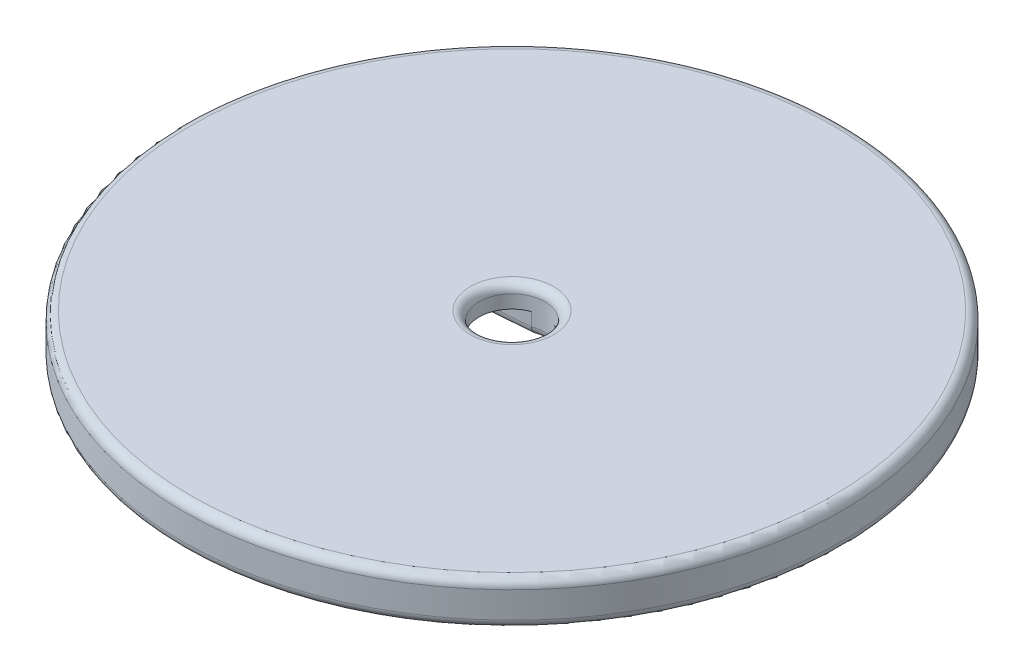
ISO-10303-21;
HEADER;
FILE_DESCRIPTION(('STEP AP214'),'2;1');
FILE_NAME('part.step','',(''),(''),'','','');
FILE_SCHEMA(('AUTOMOTIVE_DESIGN { 1 0 10303 214 1 1 1 1 }'));
ENDSEC;
DATA;
#1=APPLICATION_CONTEXT('core data for automotive mechanical design processes');
#2=APPLICATION_PROTOCOL_DEFINITION('international standard','automotive_design',2000,#1);
#3=PRODUCT_CONTEXT('',#1,'mechanical');
#4=PRODUCT('Part','Part','',(#3));
#5=PRODUCT_RELATED_PRODUCT_CATEGORY('part','',(#4));
#6=PRODUCT_DEFINITION_FORMATION('','',#4);
#7=PRODUCT_DEFINITION_CONTEXT('part definition',#1,'design');
#8=PRODUCT_DEFINITION('design','',#6,#7);
#9=PRODUCT_DEFINITION_SHAPE('','',#8);
#10=(LENGTH_UNIT() NAMED_UNIT(*) SI_UNIT(.MILLI.,.METRE.));
#11=(NAMED_UNIT(*) PLANE_ANGLE_UNIT() SI_UNIT($,.RADIAN.));
#12=(NAMED_UNIT(*) SI_UNIT($,.STERADIAN.) SOLID_ANGLE_UNIT());
#13=UNCERTAINTY_MEASURE_WITH_UNIT(LENGTH_MEASURE(1.E-05),#10,'distance_accuracy_value','');
#14=(GEOMETRIC_REPRESENTATION_CONTEXT(3) GLOBAL_UNCERTAINTY_ASSIGNED_CONTEXT((#13)) GLOBAL_UNIT_ASSIGNED_CONTEXT((#10,
#11,#12)) REPRESENTATION_CONTEXT('',''));
#15=CARTESIAN_POINT('',(0.,0.,0.));
#16=DIRECTION('',(0.,0.,1.));
#17=DIRECTION('',(1.,0.,0.));
#18=AXIS2_PLACEMENT_3D('',#15,#16,#17);
#19=CARTESIAN_POINT('',(0.,5.,0.));
#20=DIRECTION('',(0.,1.,0.));
#21=DIRECTION('',(0.,0.,1.));
#22=AXIS2_PLACEMENT_3D('',#19,#20,#21);
#23=PLANE('',#22);
#24=CARTESIAN_POINT('',(0.,5.,0.));
#25=DIRECTION('',(0.,1.,0.));
#26=DIRECTION('',(0.,0.,1.));
#27=AXIS2_PLACEMENT_3D('',#24,#25,#26);
#28=CIRCLE('',#27,4.75);
#29=CARTESIAN_POINT('',(0.,5.,4.75));
#30=VERTEX_POINT('',#29);
#31=EDGE_CURVE('E192',#30,#30,#28,.F.);
#32=ORIENTED_EDGE('',*,*,#31,.T.);
#33=EDGE_LOOP('',(#32));
#34=FACE_BOUND('',#33,.T.);
#35=CARTESIAN_POINT('',(0.,5.,0.));
#36=DIRECTION('',(0.,1.,0.));
#37=DIRECTION('',(0.,0.,1.));
#38=AXIS2_PLACEMENT_3D('',#35,#36,#37);
#39=CIRCLE('',#38,36.5);
#40=CARTESIAN_POINT('',(0.,5.,36.5));
#41=VERTEX_POINT('',#40);
#42=EDGE_CURVE('E189',#41,#41,#39,.T.);
#43=ORIENTED_EDGE('',*,*,#42,.T.);
#44=EDGE_LOOP('',(#43));
#45=FACE_BOUND('',#44,.T.);
#46=ADVANCED_FACE('F33',(#34,#45),#23,.T.);
#47=CARTESIAN_POINT('',(0.,0.,0.));
#48=DIRECTION('',(0.,1.,0.));
#49=DIRECTION('',(0.,0.,1.));
#50=AXIS2_PLACEMENT_3D('',#47,#48,#49);
#51=PLANE('',#50);
#52=CARTESIAN_POINT('',(-14.,0.,0.));
#53=DIRECTION('',(0.,1.,0.));
#54=DIRECTION('',(0.,0.,1.));
#55=AXIS2_PLACEMENT_3D('',#52,#53,#54);
#56=CIRCLE('',#55,3.5);
#57=CARTESIAN_POINT('',(-14.0432462708104,0.,-3.49973281266742));
#58=VERTEX_POINT('',#57);
#59=CARTESIAN_POINT('',(-14.044208944618,0.,3.49972078446492));
#60=VERTEX_POINT('',#59);
#61=EDGE_CURVE('E219',#58,#60,#56,.T.);
#62=ORIENTED_EDGE('',*,*,#61,.T.);
#63=DIRECTION('',(-0.99667751679695,0.,-0.0814489257846058));
#64=VECTOR('',#63,1.);
#65=CARTESIAN_POINT('',(-0.377269693687086,0.,4.6165890813732));
#66=LINE('',#65,#64);
#67=CARTESIAN_POINT('',(-1.42604386588446,0.,4.53088279395675));
#68=VERTEX_POINT('',#67);
#69=EDGE_CURVE('E221',#60,#68,#66,.F.);
#70=ORIENTED_EDGE('',*,*,#69,.T.);
#71=CARTESIAN_POINT('',(0.,0.,0.));
#72=DIRECTION('',(0.,1.,0.));
#73=DIRECTION('',(0.,0.,1.));
#74=AXIS2_PLACEMENT_3D('',#71,#72,#73);
#75=CIRCLE('',#74,4.75);
#76=CARTESIAN_POINT('',(1.42604386588446,0.,4.53088279395675));
#77=VERTEX_POINT('',#76);
#78=EDGE_CURVE('E207',#68,#77,#75,.T.);
#79=ORIENTED_EDGE('',*,*,#78,.T.);
#80=DIRECTION('',(-0.99667751679695,0.,0.0814489257846057));
#81=VECTOR('',#80,1.);
#82=CARTESIAN_POINT('',(0.377269693687079,0.,4.6165890813732));
#83=LINE('',#82,#81);
#84=CARTESIAN_POINT('',(14.044208944618,0.,3.49972078446492));
#85=VERTEX_POINT('',#84);
#86=EDGE_CURVE('E209',#77,#85,#83,.F.);
#87=ORIENTED_EDGE('',*,*,#86,.T.);
#88=CARTESIAN_POINT('',(14.,0.,0.));
#89=DIRECTION('',(0.,1.,0.));
#90=DIRECTION('',(0.,0.,1.));
#91=AXIS2_PLACEMENT_3D('',#88,#89,#90);
#92=CIRCLE('',#91,3.5);
#93=CARTESIAN_POINT('',(14.0432462708104,0.,-3.49973281266742));
#94=VERTEX_POINT('',#93);
#95=EDGE_CURVE('E211',#85,#94,#92,.T.);
#96=ORIENTED_EDGE('',*,*,#95,.T.);
#97=DIRECTION('',(0.996820452269971,0.,0.0796805241968842));
#98=VECTOR('',#97,1.);
#99=CARTESIAN_POINT('',(0.367134267722561,0.,-4.5929284537679));
#100=LINE('',#99,#98);
#101=CARTESIAN_POINT('',(1.51789889325711,0.,-4.50094245129271));
#102=VERTEX_POINT('',#101);
#103=EDGE_CURVE('E213',#94,#102,#100,.F.);
#104=ORIENTED_EDGE('',*,*,#103,.T.);
#105=CARTESIAN_POINT('',(0.,0.,0.));
#106=DIRECTION('',(0.,1.,0.));
#107=DIRECTION('',(0.,0.,1.));
#108=AXIS2_PLACEMENT_3D('',#105,#106,#107);
#109=CIRCLE('',#108,4.75);
#110=CARTESIAN_POINT('',(-1.51789889325711,0.,-4.50094245129271));
#111=VERTEX_POINT('',#110);
#112=EDGE_CURVE('E215',#102,#111,#109,.T.);
#113=ORIENTED_EDGE('',*,*,#112,.T.);
#114=DIRECTION('',(0.996820452269971,0.,-0.0796805241968842));
#115=VECTOR('',#114,1.);
#116=CARTESIAN_POINT('',(-0.367134267722568,0.,-4.5929284537679));
#117=LINE('',#116,#115);
#118=EDGE_CURVE('E217',#111,#58,#117,.F.);
#119=ORIENTED_EDGE('',*,*,#118,.T.);
#120=EDGE_LOOP('',(#62,#70,#79,#87,#96,#104,#113,#119));
#121=FACE_BOUND('',#120,.T.);
#122=CARTESIAN_POINT('',(0.,0.,0.));
#123=DIRECTION('',(0.,1.,0.));
#124=DIRECTION('',(0.,0.,1.));
#125=AXIS2_PLACEMENT_3D('',#122,#123,#124);
#126=CIRCLE('',#125,36.5);
#127=CARTESIAN_POINT('',(0.,0.,36.5));
#128=VERTEX_POINT('',#127);
#129=EDGE_CURVE('E204',#128,#128,#126,.F.);
#130=ORIENTED_EDGE('',*,*,#129,.T.);
#131=EDGE_LOOP('',(#130));
#132=FACE_BOUND('',#131,.T.);
#133=ADVANCED_FACE('F309',(#121,#132),#51,.F.);
#134=CARTESIAN_POINT('',(0.,5.,0.));
#135=DIRECTION('',(0.,-1.,0.));
#136=DIRECTION('',(0.,0.,-1.));
#137=AXIS2_PLACEMENT_3D('',#134,#135,#136);
#138=CYLINDRICAL_SURFACE('',#137,37.5);
#139=CARTESIAN_POINT('',(0.,4.,0.));
#140=DIRECTION('',(0.,1.,0.));
#141=DIRECTION('',(0.,0.,1.));
#142=AXIS2_PLACEMENT_3D('',#139,#140,#141);
#143=CIRCLE('',#142,37.5);
#144=CARTESIAN_POINT('',(0.,4.,37.5));
#145=VERTEX_POINT('',#144);
#146=EDGE_CURVE('E198',#145,#145,#143,.F.);
#147=ORIENTED_EDGE('',*,*,#146,.T.);
#148=EDGE_LOOP('',(#147));
#149=FACE_BOUND('',#148,.T.);
#150=CARTESIAN_POINT('',(0.,1.,0.));
#151=DIRECTION('',(0.,1.,0.));
#152=DIRECTION('',(0.,0.,1.));
#153=AXIS2_PLACEMENT_3D('',#150,#151,#152);
#154=CIRCLE('',#153,37.5);
#155=CARTESIAN_POINT('',(0.,1.,37.5));
#156=VERTEX_POINT('',#155);
#157=EDGE_CURVE('E195',#156,#156,#154,.T.);
#158=ORIENTED_EDGE('',*,*,#157,.T.);
#159=EDGE_LOOP('',(#158));
#160=FACE_BOUND('',#159,.T.);
#161=ADVANCED_FACE('F315',(#149,#160),#138,.T.);
#162=CARTESIAN_POINT('',(0.,5.,0.));
#163=DIRECTION('',(0.,-1.,0.));
#164=DIRECTION('',(0.,0.,-1.));
#165=AXIS2_PLACEMENT_3D('',#162,#163,#164);
#166=CYLINDRICAL_SURFACE('',#165,3.75);
#167=CARTESIAN_POINT('',(0.,4.,0.));
#168=DIRECTION('',(0.,1.,0.));
#169=DIRECTION('',(0.,0.,1.));
#170=AXIS2_PLACEMENT_3D('',#167,#168,#169);
#171=CIRCLE('',#170,3.75);
#172=CARTESIAN_POINT('',(0.,4.,3.75));
#173=VERTEX_POINT('',#172);
#174=EDGE_CURVE('E186',#173,#173,#171,.T.);
#175=ORIENTED_EDGE('',*,*,#174,.T.);
#176=EDGE_LOOP('',(#175));
#177=FACE_BOUND('',#176,.T.);
#178=DIRECTION('',(0.,-1.,0.));
#179=VECTOR('',#178,1.);
#180=CARTESIAN_POINT('',(-1.30785789229885,2.5,-3.5145423220601));
#181=LINE('',#180,#179);
#182=CARTESIAN_POINT('',(-1.30785789229885,2.5,-3.5145423220601));
#183=VERTEX_POINT('',#182);
#184=CARTESIAN_POINT('',(-1.30785789229885,1.,-3.5145423220601));
#185=VERTEX_POINT('',#184);
#186=EDGE_CURVE('E138',#183,#185,#181,.T.);
#187=ORIENTED_EDGE('',*,*,#186,.T.);
#188=CARTESIAN_POINT('',(0.,1.,0.));
#189=DIRECTION('',(0.,1.,0.));
#190=DIRECTION('',(0.,0.,1.));
#191=AXIS2_PLACEMENT_3D('',#188,#189,#190);
#192=CIRCLE('',#191,3.75);
#193=CARTESIAN_POINT('',(1.30785789229884,1.,-3.5145423220601));
#194=VERTEX_POINT('',#193);
#195=EDGE_CURVE('E184',#185,#194,#192,.F.);
#196=ORIENTED_EDGE('',*,*,#195,.T.);
#197=DIRECTION('',(0.,-1.,0.));
#198=VECTOR('',#197,1.);
#199=CARTESIAN_POINT('',(1.30785789229884,2.5,-3.5145423220601));
#200=LINE('',#199,#198);
#201=CARTESIAN_POINT('',(1.30785789229884,2.5,-3.5145423220601));
#202=VERTEX_POINT('',#201);
#203=EDGE_CURVE('E176',#202,#194,#200,.T.);
#204=ORIENTED_EDGE('',*,*,#203,.F.);
#205=CARTESIAN_POINT('',(0.,2.5,0.));
#206=DIRECTION('',(0.,-1.,0.));
#207=DIRECTION('',(0.,0.,-1.));
#208=AXIS2_PLACEMENT_3D('',#205,#206,#207);
#209=CIRCLE('',#208,3.75);
#210=CARTESIAN_POINT('',(1.22611677403016,2.5,3.54388736508962));
#211=VERTEX_POINT('',#210);
#212=EDGE_CURVE('E179',#202,#211,#209,.T.);
#213=ORIENTED_EDGE('',*,*,#212,.T.);
#214=DIRECTION('',(0.,-1.,0.));
#215=VECTOR('',#214,1.);
#216=CARTESIAN_POINT('',(1.22611677403016,2.5,3.54388736508962));
#217=LINE('',#216,#215);
#218=CARTESIAN_POINT('',(1.22611677403016,1.,3.54388736508962));
#219=VERTEX_POINT('',#218);
#220=EDGE_CURVE('E169',#211,#219,#217,.T.);
#221=ORIENTED_EDGE('',*,*,#220,.T.);
#222=CARTESIAN_POINT('',(0.,1.,0.));
#223=DIRECTION('',(0.,1.,0.));
#224=DIRECTION('',(0.,0.,1.));
#225=AXIS2_PLACEMENT_3D('',#222,#223,#224);
#226=CIRCLE('',#225,3.75);
#227=CARTESIAN_POINT('',(-1.22611677403017,1.,3.54388736508962));
#228=VERTEX_POINT('',#227);
#229=EDGE_CURVE('E182',#219,#228,#226,.F.);
#230=ORIENTED_EDGE('',*,*,#229,.T.);
#231=DIRECTION('',(0.,-1.,0.));
#232=VECTOR('',#231,1.);
#233=CARTESIAN_POINT('',(-1.22611677403017,2.5,3.54388736508962));
#234=LINE('',#233,#232);
#235=CARTESIAN_POINT('',(-1.22611677403017,2.5,3.54388736508962));
#236=VERTEX_POINT('',#235);
#237=EDGE_CURVE('E166',#236,#228,#234,.T.);
#238=ORIENTED_EDGE('',*,*,#237,.F.);
#239=EDGE_CURVE('E165',#236,#183,#209,.T.);
#240=ORIENTED_EDGE('',*,*,#239,.T.);
#241=EDGE_LOOP('',(#187,#196,#204,#213,#221,#230,#238,#240));
#242=FACE_BOUND('',#241,.T.);
#243=ADVANCED_FACE('F320',(#177,#242),#166,.F.);
#244=CARTESIAN_POINT('',(-14.,2.5,0.));
#245=DIRECTION('',(0.,-1.,0.));
#246=DIRECTION('',(0.,0.,-1.));
#247=AXIS2_PLACEMENT_3D('',#244,#245,#246);
#248=PLANE('',#247);
#249=DIRECTION('',(-0.99667751679695,0.,-0.0814489257846058));
#250=VECTOR('',#249,1.);
#251=CARTESIAN_POINT('',(-14.,2.5,2.5));
#252=LINE('',#251,#250);
#253=CARTESIAN_POINT('',(-14.,2.5,2.5));
#254=VERTEX_POINT('',#253);
#255=EDGE_CURVE('E139',#236,#254,#252,.T.);
#256=ORIENTED_EDGE('',*,*,#255,.T.);
#257=CARTESIAN_POINT('',(-14.,2.5,0.));
#258=DIRECTION('',(0.,-1.,0.));
#259=DIRECTION('',(0.,0.,-1.));
#260=AXIS2_PLACEMENT_3D('',#257,#258,#259);
#261=CIRCLE('',#260,2.5);
#262=CARTESIAN_POINT('',(-14.,2.5,-2.5));
#263=VERTEX_POINT('',#262);
#264=EDGE_CURVE('E132',#254,#263,#261,.T.);
#265=ORIENTED_EDGE('',*,*,#264,.T.);
#266=DIRECTION('',(0.996820452269971,0.,-0.0796805241968842));
#267=VECTOR('',#266,1.);
#268=CARTESIAN_POINT('',(-1.30785789229885,2.5,-3.5145423220601));
#269=LINE('',#268,#267);
#270=EDGE_CURVE('E142',#263,#183,#269,.T.);
#271=ORIENTED_EDGE('',*,*,#270,.T.);
#272=ORIENTED_EDGE('',*,*,#239,.F.);
#273=EDGE_LOOP('',(#256,#265,#271,#272));
#274=FACE_BOUND('',#273,.T.);
#275=ADVANCED_FACE('F149',(#274),#248,.T.);
#276=CARTESIAN_POINT('',(-1.30785789229885,2.5,-3.5145423220601));
#277=DIRECTION('',(-0.0796805241968842,0.,-0.996820452269971));
#278=DIRECTION('',(-0.996820452269971,0.,0.0796805241968842));
#279=AXIS2_PLACEMENT_3D('',#276,#277,#278);
#280=PLANE('',#279);
#281=DIRECTION('',(0.,-1.,0.));
#282=VECTOR('',#281,1.);
#283=CARTESIAN_POINT('',(-14.,2.5,-2.5));
#284=LINE('',#283,#282);
#285=CARTESIAN_POINT('',(-14.,1.,-2.5));
#286=VERTEX_POINT('',#285);
#287=EDGE_CURVE('E127',#263,#286,#284,.T.);
#288=ORIENTED_EDGE('',*,*,#287,.T.);
#289=DIRECTION('',(0.996820452269971,0.,-0.0796805241968842));
#290=VECTOR('',#289,1.);
#291=CARTESIAN_POINT('',(-1.30785789229885,1.,-3.5145423220601));
#292=LINE('',#291,#290);
#293=EDGE_CURVE('E225',#286,#185,#292,.T.);
#294=ORIENTED_EDGE('',*,*,#293,.T.);
#295=ORIENTED_EDGE('',*,*,#186,.F.);
#296=ORIENTED_EDGE('',*,*,#270,.F.);
#297=EDGE_LOOP('',(#288,#294,#295,#296));
#298=FACE_BOUND('',#297,.T.);
#299=ADVANCED_FACE('F143',(#298),#280,.F.);
#300=CARTESIAN_POINT('',(-14.,2.5,2.5));
#301=DIRECTION('',(-0.0814489257846058,0.,0.99667751679695));
#302=DIRECTION('',(0.99667751679695,0.,0.0814489257846058));
#303=AXIS2_PLACEMENT_3D('',#300,#301,#302);
#304=PLANE('',#303);
#305=ORIENTED_EDGE('',*,*,#237,.T.);
#306=DIRECTION('',(-0.99667751679695,0.,-0.0814489257846058));
#307=VECTOR('',#306,1.);
#308=CARTESIAN_POINT('',(-14.,1.,2.5));
#309=LINE('',#308,#307);
#310=CARTESIAN_POINT('',(-14.,1.,2.5));
#311=VERTEX_POINT('',#310);
#312=EDGE_CURVE('E201',#228,#311,#309,.T.);
#313=ORIENTED_EDGE('',*,*,#312,.T.);
#314=DIRECTION('',(0.,-1.,0.));
#315=VECTOR('',#314,1.);
#316=CARTESIAN_POINT('',(-14.,2.5,2.5));
#317=LINE('',#316,#315);
#318=EDGE_CURVE('E163',#254,#311,#317,.T.);
#319=ORIENTED_EDGE('',*,*,#318,.F.);
#320=ORIENTED_EDGE('',*,*,#255,.F.);
#321=EDGE_LOOP('',(#305,#313,#319,#320));
#322=FACE_BOUND('',#321,.T.);
#323=ADVANCED_FACE('F380',(#322),#304,.F.);
#324=CARTESIAN_POINT('',(-14.,2.5,0.));
#325=DIRECTION('',(0.,-1.,0.));
#326=DIRECTION('',(0.,0.,-1.));
#327=AXIS2_PLACEMENT_3D('',#324,#325,#326);
#328=CYLINDRICAL_SURFACE('',#327,2.5);
#329=ORIENTED_EDGE('',*,*,#318,.T.);
#330=CARTESIAN_POINT('',(-14.,1.,0.));
#331=DIRECTION('',(0.,1.,0.));
#332=DIRECTION('',(0.,0.,1.));
#333=AXIS2_PLACEMENT_3D('',#330,#331,#332);
#334=CIRCLE('',#333,2.5);
#335=EDGE_CURVE('E135',#311,#286,#334,.F.);
#336=ORIENTED_EDGE('',*,*,#335,.T.);
#337=ORIENTED_EDGE('',*,*,#287,.F.);
#338=ORIENTED_EDGE('',*,*,#264,.F.);
#339=EDGE_LOOP('',(#329,#336,#337,#338));
#340=FACE_BOUND('',#339,.T.);
#341=ADVANCED_FACE('F130',(#340),#328,.F.);
#342=DIRECTION('',(0.996820452269971,0.,0.0796805241968842));
#343=VECTOR('',#342,1.);
#344=CARTESIAN_POINT('',(14.,2.5,-2.5));
#345=LINE('',#344,#343);
#346=CARTESIAN_POINT('',(14.,2.5,-2.5));
#347=VERTEX_POINT('',#346);
#348=EDGE_CURVE('E147',#202,#347,#345,.T.);
#349=ORIENTED_EDGE('',*,*,#348,.T.);
#350=CARTESIAN_POINT('',(14.,2.5,0.));
#351=DIRECTION('',(0.,-1.,0.));
#352=DIRECTION('',(0.,0.,-1.));
#353=AXIS2_PLACEMENT_3D('',#350,#351,#352);
#354=CIRCLE('',#353,2.5);
#355=CARTESIAN_POINT('',(14.,2.5,2.5));
#356=VERTEX_POINT('',#355);
#357=EDGE_CURVE('E157',#347,#356,#354,.T.);
#358=ORIENTED_EDGE('',*,*,#357,.T.);
#359=DIRECTION('',(-0.99667751679695,0.,0.0814489257846057));
#360=VECTOR('',#359,1.);
#361=CARTESIAN_POINT('',(14.,2.5,2.5));
#362=LINE('',#361,#360);
#363=EDGE_CURVE('E160',#356,#211,#362,.T.);
#364=ORIENTED_EDGE('',*,*,#363,.T.);
#365=ORIENTED_EDGE('',*,*,#212,.F.);
#366=EDGE_LOOP('',(#349,#358,#364,#365));
#367=FACE_BOUND('',#366,.T.);
#368=ADVANCED_FACE('F369',(#367),#248,.T.);
#369=CARTESIAN_POINT('',(14.,2.5,2.5));
#370=DIRECTION('',(0.0814489257846057,0.,0.99667751679695));
#371=DIRECTION('',(0.99667751679695,0.,-0.0814489257846057));
#372=AXIS2_PLACEMENT_3D('',#369,#370,#371);
#373=PLANE('',#372);
#374=DIRECTION('',(0.,-1.,0.));
#375=VECTOR('',#374,1.);
#376=CARTESIAN_POINT('',(14.,2.5,2.5));
#377=LINE('',#376,#375);
#378=CARTESIAN_POINT('',(14.,1.,2.5));
#379=VERTEX_POINT('',#378);
#380=EDGE_CURVE('E172',#356,#379,#377,.T.);
#381=ORIENTED_EDGE('',*,*,#380,.T.);
#382=DIRECTION('',(-0.99667751679695,0.,0.0814489257846057));
#383=VECTOR('',#382,1.);
#384=CARTESIAN_POINT('',(14.,1.,2.5));
#385=LINE('',#384,#383);
#386=EDGE_CURVE('E11',#379,#219,#385,.T.);
#387=ORIENTED_EDGE('',*,*,#386,.T.);
#388=ORIENTED_EDGE('',*,*,#220,.F.);
#389=ORIENTED_EDGE('',*,*,#363,.F.);
#390=EDGE_LOOP('',(#381,#387,#388,#389));
#391=FACE_BOUND('',#390,.T.);
#392=ADVANCED_FACE('F365',(#391),#373,.F.);
#393=CARTESIAN_POINT('',(14.,2.5,0.));
#394=DIRECTION('',(0.,-1.,0.));
#395=DIRECTION('',(0.,0.,-1.));
#396=AXIS2_PLACEMENT_3D('',#393,#394,#395);
#397=CYLINDRICAL_SURFACE('',#396,2.5);
#398=DIRECTION('',(0.,-1.,0.));
#399=VECTOR('',#398,1.);
#400=CARTESIAN_POINT('',(14.,2.5,-2.5));
#401=LINE('',#400,#399);
#402=CARTESIAN_POINT('',(14.,1.,-2.5));
#403=VERTEX_POINT('',#402);
#404=EDGE_CURVE('E174',#347,#403,#401,.T.);
#405=ORIENTED_EDGE('',*,*,#404,.T.);
#406=CARTESIAN_POINT('',(14.,1.,0.));
#407=DIRECTION('',(0.,1.,0.));
#408=DIRECTION('',(0.,0.,1.));
#409=AXIS2_PLACEMENT_3D('',#406,#407,#408);
#410=CIRCLE('',#409,2.5);
#411=EDGE_CURVE('E46',#403,#379,#410,.F.);
#412=ORIENTED_EDGE('',*,*,#411,.T.);
#413=ORIENTED_EDGE('',*,*,#380,.F.);
#414=ORIENTED_EDGE('',*,*,#357,.F.);
#415=EDGE_LOOP('',(#405,#412,#413,#414));
#416=FACE_BOUND('',#415,.T.);
#417=ADVANCED_FACE('F332',(#416),#397,.F.);
#418=CARTESIAN_POINT('',(14.,2.5,-2.5));
#419=DIRECTION('',(0.0796805241968842,0.,-0.996820452269971));
#420=DIRECTION('',(-0.996820452269971,0.,-0.0796805241968842));
#421=AXIS2_PLACEMENT_3D('',#418,#419,#420);
#422=PLANE('',#421);
#423=ORIENTED_EDGE('',*,*,#203,.T.);
#424=DIRECTION('',(0.996820452269971,0.,0.0796805241968842));
#425=VECTOR('',#424,1.);
#426=CARTESIAN_POINT('',(14.,1.,-2.5));
#427=LINE('',#426,#425);
#428=EDGE_CURVE('E61',#194,#403,#427,.T.);
#429=ORIENTED_EDGE('',*,*,#428,.T.);
#430=ORIENTED_EDGE('',*,*,#404,.F.);
#431=ORIENTED_EDGE('',*,*,#348,.F.);
#432=EDGE_LOOP('',(#423,#429,#430,#431));
#433=FACE_BOUND('',#432,.T.);
#434=ADVANCED_FACE('F327',(#433),#422,.F.);
#435=CARTESIAN_POINT('',(0.,4.,0.));
#436=DIRECTION('',(0.,1.,0.));
#437=DIRECTION('',(0.,0.,1.));
#438=AXIS2_PLACEMENT_3D('',#435,#436,#437);
#439=TOROIDAL_SURFACE('',#438,4.75,1.);
#440=ORIENTED_EDGE('',*,*,#31,.F.);
#441=EDGE_LOOP('',(#440));
#442=FACE_BOUND('',#441,.T.);
#443=ORIENTED_EDGE('',*,*,#174,.F.);
#444=EDGE_LOOP('',(#443));
#445=FACE_BOUND('',#444,.T.);
#446=ADVANCED_FACE('F305',(#442,#445),#439,.T.);
#447=CARTESIAN_POINT('',(0.,4.,0.));
#448=DIRECTION('',(0.,1.,0.));
#449=DIRECTION('',(0.,0.,1.));
#450=AXIS2_PLACEMENT_3D('',#447,#448,#449);
#451=TOROIDAL_SURFACE('',#450,36.5,1.);
#452=ORIENTED_EDGE('',*,*,#146,.F.);
#453=EDGE_LOOP('',(#452));
#454=FACE_BOUND('',#453,.T.);
#455=ORIENTED_EDGE('',*,*,#42,.F.);
#456=EDGE_LOOP('',(#455));
#457=FACE_BOUND('',#456,.T.);
#458=ADVANCED_FACE('F299',(#454,#457),#451,.T.);
#459=CARTESIAN_POINT('',(14.0796805241969,1.,-3.49682045226997));
#460=DIRECTION('',(0.996820452269971,0.,0.0796805241968842));
#461=DIRECTION('',(0.0796805241968842,0.,-0.996820452269971));
#462=AXIS2_PLACEMENT_3D('',#459,#460,#461);
#463=CYLINDRICAL_SURFACE('',#462,1.);
#464=CARTESIAN_POINT('',(1.30785789229884,1.,-3.5145423220601));
#465=CARTESIAN_POINT('',(1.30785777474969,0.972053629638289,-3.51454237401585));
#466=CARTESIAN_POINT('',(1.30811388633835,0.944120725248066,-3.51569784383512));
#467=CARTESIAN_POINT('',(1.30913459236028,0.888456445811248,-3.52030659699982));
#468=CARTESIAN_POINT('',(1.3098991516256,0.860725056960464,-3.52375972142264));
#469=CARTESIAN_POINT('',(1.31294578913211,0.778192233744312,-3.53752909915196));
#470=CARTESIAN_POINT('',(1.31598085977265,0.723946337867959,-3.55125546988944));
#471=CARTESIAN_POINT('',(1.32394943186433,0.618590677707555,-3.58740128802414));
#472=CARTESIAN_POINT('',(1.32888363889715,0.56748208721178,-3.60982396636385));
#473=CARTESIAN_POINT('',(1.34047347943796,0.469822012465478,-3.66270132638389));
#474=CARTESIAN_POINT('',(1.34712885981545,0.423269859492834,-3.69315482699572));
#475=CARTESIAN_POINT('',(1.36196554882692,0.335808311059816,-3.7613672951651));
#476=CARTESIAN_POINT('',(1.37015352045605,0.294924965922208,-3.79915819013435));
#477=CARTESIAN_POINT('',(1.38776792502077,0.220147855120147,-3.88089236568615));
#478=CARTESIAN_POINT('',(1.39719477904336,0.186256476084137,-3.92483773846529));
#479=CARTESIAN_POINT('',(1.41707532047679,0.126124064139572,-4.01804639525374));
#480=CARTESIAN_POINT('',(1.42753745681755,0.0999543502605557,-4.06735382776122));
#481=CARTESIAN_POINT('',(1.44909464742805,0.0564006691936169,-4.1695565988724));
#482=CARTESIAN_POINT('',(1.46018923285789,0.0390102856967541,-4.22244928505823));
#483=CARTESIAN_POINT('',(1.47868058211237,0.0180025112688947,-4.31112475255432));
#484=CARTESIAN_POINT('',(1.48599137256866,0.0116871591113422,-4.3463132794913));
#485=CARTESIAN_POINT('',(1.50064919973318,0.00295965663153222,-4.41712582334924));
#486=CARTESIAN_POINT('',(1.50799615845734,0.000541194598069169,-4.45274904170606));
#487=CARTESIAN_POINT('',(1.5161783646304,2.69572766284771E-05,-4.49256480541301));
#488=CARTESIAN_POINT('',(1.51703884611013,-7.14597422945992E-08,-4.49675380020807));
#489=CARTESIAN_POINT('',(1.5178988932571,0.,-4.50094245129271));
#490=B_SPLINE_CURVE_WITH_KNOTS('',3,(#464,#465,#466,#467,#468,#469,#470,#471,#472,#473,#474,
#475,#476,#477,#478,#479,#480,#481,#482,#483,#484,#485,#486,#487,#488,#489),.UNSPECIFIED.,.F.,
.F.,(4,2,2,2,2,2,2,2,2,2,2,2,4),(0.,0.0837873547500024,0.167568914755957,0.33481868006812,
0.5021306433675,0.669418014316641,0.83745031679007,1.00553988063451,1.17513656658576,
1.34460912395737,1.45389845588036,1.56301059558268,1.57583982848293),.UNSPECIFIED.);
#491=EDGE_CURVE('E153',#102,#194,#490,.F.);
#492=ORIENTED_EDGE('',*,*,#491,.F.);
#493=ORIENTED_EDGE('',*,*,#103,.F.);
#494=CARTESIAN_POINT('',(14.,1.,-2.5));
#495=CARTESIAN_POINT('',(14.0000000620272,0.971881586325615,-2.50000017118659));
#496=CARTESIAN_POINT('',(14.0000473486308,0.943776651044286,-2.50118671340195));
#497=CARTESIAN_POINT('',(14.0002363445709,0.887768021685893,-2.50592020500383));
#498=CARTESIAN_POINT('',(14.0003780492149,0.859864317677495,-2.50946703708627));
#499=CARTESIAN_POINT('',(14.0009441516403,0.776801166625658,-2.52361450108084));
#500=CARTESIAN_POINT('',(14.0015095387539,0.722198375134595,-2.53772219212296));
#501=CARTESIAN_POINT('',(14.0030093886784,0.61614032631214,-2.57489552826867));
#502=CARTESIAN_POINT('',(14.0039440246371,0.564686558708178,-2.59796537580952));
#503=CARTESIAN_POINT('',(14.0061687470096,0.466388143826865,-2.65240099147054));
#504=CARTESIAN_POINT('',(14.0074587498811,0.419542416764456,-2.68376480971143));
#505=CARTESIAN_POINT('',(14.0103729674074,0.33176768869966,-2.7539084303553));
#506=CARTESIAN_POINT('',(14.0119972917696,0.290840637433866,-2.7926906668138));
#507=CARTESIAN_POINT('',(14.0155489504615,0.216062845991627,-2.87657987305729));
#508=CARTESIAN_POINT('',(14.0174763946198,0.182214681089363,-2.92168913465606));
#509=CARTESIAN_POINT('',(14.0215928735016,0.122541395999792,-3.01698112318419));
#510=CARTESIAN_POINT('',(14.0237821754603,0.0967245704901138,-3.06716902486897));
#511=CARTESIAN_POINT('',(14.0283661543215,0.0539103948441469,-3.17113486024254));
#512=CARTESIAN_POINT('',(14.0307606244158,0.0369042826527005,-3.22490916701259));
#513=CARTESIAN_POINT('',(14.0346697091764,0.01727508440709,-3.31182218249213));
#514=CARTESIAN_POINT('',(14.0361392281587,0.0116125077475554,-3.34431000236397));
#515=CARTESIAN_POINT('',(14.0391114159987,0.00352663460252359,-3.40965446528723));
#516=CARTESIAN_POINT('',(14.0406140350027,0.00109876549921207,-3.44251052135245));
#517=CARTESIAN_POINT('',(14.0424986850904,9.86769760674624E-05,-3.48350355881988));
#518=CARTESIAN_POINT('',(14.0428722685254,-2.66827099365418E-07,-3.4916188646569));
#519=CARTESIAN_POINT('',(14.0432462708104,0.,-3.49973281266742));
#520=B_SPLINE_CURVE_WITH_KNOTS('',3,(#494,#495,#496,#497,#498,#499,#500,#501,#502,#503,#504,
#505,#506,#507,#508,#509,#510,#511,#512,#513,#514,#515,#516,#517,#518,#519),.UNSPECIFIED.,.F.,
.F.,(4,2,2,2,2,2,2,2,2,2,2,2,4),(0.,0.0843034053545826,0.16860262122596,0.336930624518539,
0.505337653811155,0.673705126429919,0.84212793711563,1.0106119132573,1.17926932446612,
1.34775868617725,1.44665371627035,1.5454087984172,1.56977953760905),.UNSPECIFIED.);
#521=EDGE_CURVE('E37',#403,#94,#520,.T.);
#522=ORIENTED_EDGE('',*,*,#521,.F.);
#523=ORIENTED_EDGE('',*,*,#428,.F.);
#524=EDGE_LOOP('',(#492,#493,#522,#523));
#525=FACE_BOUND('',#524,.T.);
#526=ADVANCED_FACE('F294',(#525),#463,.T.);
#527=CARTESIAN_POINT('',(14.,1.,0.));
#528=DIRECTION('',(0.,1.,0.));
#529=DIRECTION('',(0.,0.,1.));
#530=AXIS2_PLACEMENT_3D('',#527,#528,#529);
#531=TOROIDAL_SURFACE('',#530,3.5,1.);
#532=ORIENTED_EDGE('',*,*,#521,.T.);
#533=ORIENTED_EDGE('',*,*,#95,.F.);
#534=CARTESIAN_POINT('',(14.,1.,2.5));
#535=CARTESIAN_POINT('',(14.0000000633764,0.971882275442587,2.50000017043309));
#536=CARTESIAN_POINT('',(14.0000484005645,0.943778029247207,2.5011866552943));
#537=CARTESIAN_POINT('',(14.0002415953048,0.88777077964419,2.50591991313321));
#538=CARTESIAN_POINT('',(14.0003864480523,0.859867766288493,2.50946656861474));
#539=CARTESIAN_POINT('',(14.0009651260536,0.776806748833984,2.52361330496649));
#540=CARTESIAN_POINT('',(14.0015430719268,0.722205396306415,2.53772024723734));
#541=CARTESIAN_POINT('',(14.0030762317871,0.616150182962972,2.57489146665258));
#542=CARTESIAN_POINT('',(14.0040316225922,0.564697810384117,2.59795994183291));
#543=CARTESIAN_POINT('',(14.0063057392542,0.466401961118412,2.65239210530852));
#544=CARTESIAN_POINT('',(14.0076243799056,0.419557407091836,2.68375384822554));
#545=CARTESIAN_POINT('',(14.0106033076435,0.331783855981842,2.75389317607871));
#546=CARTESIAN_POINT('',(14.0122637129244,0.290856913776756,2.79267332623409));
#547=CARTESIAN_POINT('',(14.0158942557848,0.216079022621701,2.87655779427117));
#548=CARTESIAN_POINT('',(14.0178645054128,0.182230643838188,2.92166439933809));
#549=CARTESIAN_POINT('',(14.022072464385,0.122555481204075,3.0169520860654));
#550=CARTESIAN_POINT('',(14.0243104550041,0.0967372377040026,3.06713849563724));
#551=CARTESIAN_POINT('',(14.02899638922,0.0539200460929845,3.17110139398836));
#552=CARTESIAN_POINT('',(14.0314441221956,0.0369123686978288,3.22487426951862));
#553=CARTESIAN_POINT('',(14.0354423890328,0.0172697227066692,3.31183335211175));
#554=CARTESIAN_POINT('',(14.0369468917804,0.0116000892409842,3.34436963602501));
#555=CARTESIAN_POINT('',(14.0399898673582,0.00350988401668533,3.40981168472486));
#556=CARTESIAN_POINT('',(14.0415282889692,0.00108471441571188,3.44271685987));
#557=CARTESIAN_POINT('',(14.0434530826293,9.65275735260779E-05,3.48366955723166));
#558=CARTESIAN_POINT('',(14.0438308043192,-2.6087252917033E-07,3.49169583767926));
#559=CARTESIAN_POINT('',(14.044208944618,0.,3.49972078446492));
#560=B_SPLINE_CURVE_WITH_KNOTS('',3,(#534,#535,#536,#537,#538,#539,#540,#541,#542,#543,#544,
#545,#546,#547,#548,#549,#550,#551,#552,#553,#554,#555,#556,#557,#558,#559),.UNSPECIFIED.,.F.,
.F.,(4,2,2,2,2,2,2,2,2,2,2,2,4),(0.,0.0843013382610102,0.168598480069809,0.336922140948977,
0.505324748426653,0.673687888155147,0.842109351943303,1.01059186236947,1.17925295234623,
1.34774661606857,1.44679243627282,1.54569774599764,1.5698023048387),.UNSPECIFIED.);
#561=EDGE_CURVE('E283',#379,#85,#560,.T.);
#562=ORIENTED_EDGE('',*,*,#561,.F.);
#563=ORIENTED_EDGE('',*,*,#411,.F.);
#564=EDGE_LOOP('',(#532,#533,#562,#563));
#565=FACE_BOUND('',#564,.T.);
#566=ADVANCED_FACE('F291',(#565),#531,.T.);
#567=CARTESIAN_POINT('',(0.,1.,0.));
#568=DIRECTION('',(0.,1.,0.));
#569=DIRECTION('',(0.,0.,1.));
#570=AXIS2_PLACEMENT_3D('',#567,#568,#569);
#571=TOROIDAL_SURFACE('',#570,4.75,1.);
#572=ORIENTED_EDGE('',*,*,#491,.T.);
#573=ORIENTED_EDGE('',*,*,#195,.F.);
#574=CARTESIAN_POINT('',(-1.30785789229885,1.,-3.5145423220601));
#575=CARTESIAN_POINT('',(-1.3078577747497,0.972053629638289,-3.51454237401585));
#576=CARTESIAN_POINT('',(-1.30811388633835,0.944120725248066,-3.51569784383512));
#577=CARTESIAN_POINT('',(-1.30913459236029,0.888456445811248,-3.52030659699982));
#578=CARTESIAN_POINT('',(-1.30989915162561,0.860725056960464,-3.52375972142264));
#579=CARTESIAN_POINT('',(-1.31294578913212,0.778192233744312,-3.53752909915196));
#580=CARTESIAN_POINT('',(-1.31598085977266,0.723946337867959,-3.55125546988944));
#581=CARTESIAN_POINT('',(-1.32394943186434,0.618590677707556,-3.58740128802414));
#582=CARTESIAN_POINT('',(-1.32888363889716,0.56748208721178,-3.60982396636385));
#583=CARTESIAN_POINT('',(-1.34047347943797,0.469822012465478,-3.66270132638389));
#584=CARTESIAN_POINT('',(-1.34712885981546,0.423269859492835,-3.69315482699572));
#585=CARTESIAN_POINT('',(-1.36196554882693,0.335808311059817,-3.7613672951651));
#586=CARTESIAN_POINT('',(-1.37015352045606,0.294924965922208,-3.79915819013435));
#587=CARTESIAN_POINT('',(-1.38776792502078,0.220147855120147,-3.88089236568615));
#588=CARTESIAN_POINT('',(-1.39719477904336,0.186256476084137,-3.92483773846529));
#589=CARTESIAN_POINT('',(-1.4170753204768,0.126124064139572,-4.01804639525374));
#590=CARTESIAN_POINT('',(-1.42753745681756,0.0999543502605557,-4.06735382776122));
#591=CARTESIAN_POINT('',(-1.44909464742806,0.056400669193617,-4.1695565988724));
#592=CARTESIAN_POINT('',(-1.4601892328579,0.0390102856967544,-4.22244928505823));
#593=CARTESIAN_POINT('',(-1.47868058211237,0.0180025112688948,-4.31112475255432));
#594=CARTESIAN_POINT('',(-1.48599137256867,0.0116871591113421,-4.3463132794913));
#595=CARTESIAN_POINT('',(-1.50064919973319,0.00295965663153215,-4.41712582334924));
#596=CARTESIAN_POINT('',(-1.50799615845735,0.000541194598069503,-4.45274904170606));
#597=CARTESIAN_POINT('',(-1.51617836463041,2.69572766285603E-05,-4.49256480541301));
#598=CARTESIAN_POINT('',(-1.51703884611014,-7.14597422467952E-08,-4.49675380020807));
#599=CARTESIAN_POINT('',(-1.51789889325711,0.,-4.50094245129271));
#600=B_SPLINE_CURVE_WITH_KNOTS('',3,(#574,#575,#576,#577,#578,#579,#580,#581,#582,#583,#584,
#585,#586,#587,#588,#589,#590,#591,#592,#593,#594,#595,#596,#597,#598,#599),.UNSPECIFIED.,.F.,
.F.,(4,2,2,2,2,2,2,2,2,2,2,2,4),(0.,0.0837873547500025,0.167568914755957,0.33481868006812,
0.5021306433675,0.669418014316641,0.83745031679007,1.00553988063451,1.17513656658576,
1.34460912395736,1.45389845588036,1.56301059558268,1.57583982848293),.UNSPECIFIED.);
#601=EDGE_CURVE('E266',#111,#185,#600,.F.);
#602=ORIENTED_EDGE('',*,*,#601,.F.);
#603=ORIENTED_EDGE('',*,*,#112,.F.);
#604=EDGE_LOOP('',(#572,#573,#602,#603));
#605=FACE_BOUND('',#604,.T.);
#606=ADVANCED_FACE('F279',(#605),#571,.T.);
#607=CARTESIAN_POINT('',(14.0814489257846,1.,3.49667751679695));
#608=DIRECTION('',(-0.99667751679695,0.,0.0814489257846057));
#609=DIRECTION('',(0.0814489257846057,0.,0.99667751679695));
#610=AXIS2_PLACEMENT_3D('',#607,#608,#609);
#611=CYLINDRICAL_SURFACE('',#610,1.);
#612=ORIENTED_EDGE('',*,*,#561,.T.);
#613=ORIENTED_EDGE('',*,*,#86,.F.);
#614=CARTESIAN_POINT('',(1.22611677403016,1.,3.54388736508962));
#615=CARTESIAN_POINT('',(1.22611667261734,0.972021423115445,3.54388744080482));
#616=CARTESIAN_POINT('',(1.22636055401638,0.944056314300427,3.54504630709404));
#617=CARTESIAN_POINT('',(1.22733258712444,0.888327569534239,3.54966876751227));
#618=CARTESIAN_POINT('',(1.22806070712122,0.860563920510057,3.55313221071723));
#619=CARTESIAN_POINT('',(1.23096240457111,0.777931847107467,3.56694357208609));
#620=CARTESIAN_POINT('',(1.23385334909307,0.723619163953721,3.58071263051819));
#621=CARTESIAN_POINT('',(1.24144550156532,0.618132048866848,3.61697549220078));
#622=CARTESIAN_POINT('',(1.24614741507889,0.566958849113108,3.63947269600871));
#623=CARTESIAN_POINT('',(1.25719495663896,0.469179186806568,3.69253236473146));
#624=CARTESIAN_POINT('',(1.26354031754734,0.422571983758197,3.72309351888715));
#625=CARTESIAN_POINT('',(1.27768506714656,0.335051243292857,3.79152855638081));
#626=CARTESIAN_POINT('',(1.28548972520514,0.294159308943184,3.82942895923818));
#627=CARTESIAN_POINT('',(1.3022843047461,0.219381374879975,3.91140316013123));
#628=CARTESIAN_POINT('',(1.31127462914158,0.185497766833757,3.95547905704225));
#629=CARTESIAN_POINT('',(1.33022552739067,0.12545086776056,4.04889530116987));
#630=CARTESIAN_POINT('',(1.3401928475645,0.0993471404515808,4.09827251559514));
#631=CARTESIAN_POINT('',(1.36073458613714,0.0559312336657065,4.20061112401023));
#632=CARTESIAN_POINT('',(1.37130853623,0.0386123714573463,4.2535697587161));
#633=CARTESIAN_POINT('',(1.38886835309926,0.0178070510145542,4.3420090565772));
#634=CARTESIAN_POINT('',(1.39577007237585,0.0115836370463583,4.37689026912549));
#635=CARTESIAN_POINT('',(1.40960956842918,0.00296677163168875,4.44707857977733));
#636=CARTESIAN_POINT('',(1.41654726966795,0.000567196545595752,4.48238490552683));
#637=CARTESIAN_POINT('',(1.42432329498177,2.96523639766162E-05,4.52209151075415));
#638=CARTESIAN_POINT('',(1.42518379940903,-7.8612133217272E-08,4.52648734482747));
#639=CARTESIAN_POINT('',(1.42604386588446,0.,4.53088279395676));
#640=B_SPLINE_CURVE_WITH_KNOTS('',3,(#614,#615,#616,#617,#618,#619,#620,#621,#622,#623,#624,
#625,#626,#627,#628,#629,#630,#631,#632,#633,#634,#635,#636,#637,#638,#639),.UNSPECIFIED.,.F.,
.F.,(4,2,2,2,2,2,2,2,2,2,2,2,4),(0.,0.0838839601496204,0.167762427377227,0.335213918425572,
0.502730715579242,0.670220300381241,0.838326779672688,1.00649053281285,1.17591051444752,
1.34520142266086,1.4533182124464,1.56126168530172,1.57469931599458),.UNSPECIFIED.);
#641=EDGE_CURVE('E260',#219,#77,#640,.T.);
#642=ORIENTED_EDGE('',*,*,#641,.F.);
#643=ORIENTED_EDGE('',*,*,#386,.F.);
#644=EDGE_LOOP('',(#612,#613,#642,#643));
#645=FACE_BOUND('',#644,.T.);
#646=ADVANCED_FACE('F276',(#645),#611,.T.);
#647=CARTESIAN_POINT('',(-1.38753841649573,1.,-4.51136277433007));
#648=DIRECTION('',(0.996820452269971,0.,-0.0796805241968842));
#649=DIRECTION('',(-0.0796805241968842,0.,-0.996820452269971));
#650=AXIS2_PLACEMENT_3D('',#647,#648,#649);
#651=CYLINDRICAL_SURFACE('',#650,1.);
#652=ORIENTED_EDGE('',*,*,#601,.T.);
#653=ORIENTED_EDGE('',*,*,#293,.F.);
#654=CARTESIAN_POINT('',(-14.,1.,-2.5));
#655=CARTESIAN_POINT('',(-14.0000000620272,0.971881586325615,-2.50000017118659));
#656=CARTESIAN_POINT('',(-14.0000473486308,0.943776651044286,-2.50118671340195));
#657=CARTESIAN_POINT('',(-14.0002363445709,0.887768021685893,-2.50592020500383));
#658=CARTESIAN_POINT('',(-14.000378049215,0.859864317677495,-2.50946703708627));
#659=CARTESIAN_POINT('',(-14.0009441516403,0.776801166625658,-2.52361450108084));
#660=CARTESIAN_POINT('',(-14.0015095387539,0.722198375134595,-2.53772219212296));
#661=CARTESIAN_POINT('',(-14.0030093886784,0.616140326312141,-2.57489552826867));
#662=CARTESIAN_POINT('',(-14.0039440246371,0.564686558708179,-2.59796537580952));
#663=CARTESIAN_POINT('',(-14.0061687470096,0.466388143826866,-2.65240099147053));
#664=CARTESIAN_POINT('',(-14.0074587498811,0.419542416764456,-2.68376480971143));
#665=CARTESIAN_POINT('',(-14.0103729674074,0.33176768869966,-2.7539084303553));
#666=CARTESIAN_POINT('',(-14.0119972917696,0.290840637433866,-2.7926906668138));
#667=CARTESIAN_POINT('',(-14.0155489504615,0.216062845991627,-2.87657987305729));
#668=CARTESIAN_POINT('',(-14.0174763946198,0.182214681089363,-2.92168913465606));
#669=CARTESIAN_POINT('',(-14.0215928735016,0.122541395999792,-3.01698112318419));
#670=CARTESIAN_POINT('',(-14.0237821754603,0.0967245704901139,-3.06716902486896));
#671=CARTESIAN_POINT('',(-14.0283661543216,0.0539103948441469,-3.17113486024254));
#672=CARTESIAN_POINT('',(-14.0307606244158,0.0369042826527006,-3.22490916701259));
#673=CARTESIAN_POINT('',(-14.0346697091763,0.0172750844070904,-3.31182218249213));
#674=CARTESIAN_POINT('',(-14.0361392281586,0.0116125077475559,-3.34431000236397));
#675=CARTESIAN_POINT('',(-14.0391114159988,0.00352663460252395,-3.40965446528723));
#676=CARTESIAN_POINT('',(-14.0406140350029,0.00109876549921218,-3.44251052135244));
#677=CARTESIAN_POINT('',(-14.0424986850905,9.86769760674591E-05,-3.48350355881987));
#678=CARTESIAN_POINT('',(-14.0428722685255,-2.66827099380555E-07,-3.49161886465689));
#679=CARTESIAN_POINT('',(-14.0432462708104,0.,-3.49973281266741));
#680=B_SPLINE_CURVE_WITH_KNOTS('',3,(#654,#655,#656,#657,#658,#659,#660,#661,#662,#663,#664,
#665,#666,#667,#668,#669,#670,#671,#672,#673,#674,#675,#676,#677,#678,#679),.UNSPECIFIED.,.F.,
.F.,(4,2,2,2,2,2,2,2,2,2,2,2,4),(0.,0.0843034053545827,0.16860262122596,0.336930624518538,
0.505337653811154,0.673705126429919,0.842127937115629,1.0106119132573,1.17926932446612,
1.34775868617725,1.44665371627035,1.54540879841719,1.56977953760904),.UNSPECIFIED.);
#681=EDGE_CURVE('E267',#58,#286,#680,.F.);
#682=ORIENTED_EDGE('',*,*,#681,.F.);
#683=ORIENTED_EDGE('',*,*,#118,.F.);
#684=EDGE_LOOP('',(#652,#653,#682,#683));
#685=FACE_BOUND('',#684,.T.);
#686=ADVANCED_FACE('F254',(#685),#651,.T.);
#687=CARTESIAN_POINT('',(0.,1.,0.));
#688=DIRECTION('',(0.,1.,0.));
#689=DIRECTION('',(0.,0.,1.));
#690=AXIS2_PLACEMENT_3D('',#687,#688,#689);
#691=TOROIDAL_SURFACE('',#690,4.75,1.);
#692=ORIENTED_EDGE('',*,*,#641,.T.);
#693=ORIENTED_EDGE('',*,*,#78,.F.);
#694=CARTESIAN_POINT('',(-1.22611677403017,1.,3.54388736508962));
#695=CARTESIAN_POINT('',(-1.22611667261735,0.972021423115445,3.54388744080482));
#696=CARTESIAN_POINT('',(-1.22636055401639,0.944056314300427,3.54504630709404));
#697=CARTESIAN_POINT('',(-1.22733258712444,0.888327569534239,3.54966876751227));
#698=CARTESIAN_POINT('',(-1.22806070712123,0.860563920510057,3.55313221071723));
#699=CARTESIAN_POINT('',(-1.23096240457111,0.777931847107467,3.56694357208609));
#700=CARTESIAN_POINT('',(-1.23385334909308,0.723619163953721,3.58071263051819));
#701=CARTESIAN_POINT('',(-1.24144550156533,0.618132048866848,3.61697549220078));
#702=CARTESIAN_POINT('',(-1.2461474150789,0.566958849113108,3.63947269600871));
#703=CARTESIAN_POINT('',(-1.25719495663896,0.469179186806568,3.69253236473146));
#704=CARTESIAN_POINT('',(-1.26354031754734,0.422571983758196,3.72309351888715));
#705=CARTESIAN_POINT('',(-1.27768506714656,0.335051243292856,3.79152855638081));
#706=CARTESIAN_POINT('',(-1.28548972520514,0.294159308943184,3.82942895923818));
#707=CARTESIAN_POINT('',(-1.30228430474611,0.219381374879975,3.91140316013123));
#708=CARTESIAN_POINT('',(-1.31127462914159,0.185497766833756,3.95547905704225));
#709=CARTESIAN_POINT('',(-1.33022552739067,0.125450867760559,4.04889530116987));
#710=CARTESIAN_POINT('',(-1.3401928475645,0.0993471404515804,4.09827251559514));
#711=CARTESIAN_POINT('',(-1.36073458613715,0.0559312336657065,4.20061112401023));
#712=CARTESIAN_POINT('',(-1.37130853623004,0.0386123714573464,4.2535697587161));
#713=CARTESIAN_POINT('',(-1.38886835309926,0.017807051014554,4.34200905657721));
#714=CARTESIAN_POINT('',(-1.39577007237583,0.0115836370463581,4.3768902691255));
#715=CARTESIAN_POINT('',(-1.40960956842922,0.00296677163168875,4.44707857977733));
#716=CARTESIAN_POINT('',(-1.41654726966809,0.000567196545595975,4.48238490552681));
#717=CARTESIAN_POINT('',(-1.42432329498181,2.96523639766675E-05,4.52209151075414));
#718=CARTESIAN_POINT('',(-1.42518379940905,-7.86121331903105E-08,4.52648734482746));
#719=CARTESIAN_POINT('',(-1.42604386588447,0.,4.53088279395676));
#720=B_SPLINE_CURVE_WITH_KNOTS('',3,(#694,#695,#696,#697,#698,#699,#700,#701,#702,#703,#704,
#705,#706,#707,#708,#709,#710,#711,#712,#713,#714,#715,#716,#717,#718,#719),.UNSPECIFIED.,.F.,
.F.,(4,2,2,2,2,2,2,2,2,2,2,2,4),(0.,0.0838839601496205,0.167762427377227,0.335213918425572,
0.502730715579242,0.670220300381241,0.838326779672689,1.00649053281285,1.17591051444752,
1.34520142266086,1.4533182124464,1.56126168530172,1.57469931599458),.UNSPECIFIED.);
#721=EDGE_CURVE('E236',#228,#68,#720,.T.);
#722=ORIENTED_EDGE('',*,*,#721,.F.);
#723=ORIENTED_EDGE('',*,*,#229,.F.);
#724=EDGE_LOOP('',(#692,#693,#722,#723));
#725=FACE_BOUND('',#724,.T.);
#726=ADVANCED_FACE('F249',(#725),#691,.T.);
#727=CARTESIAN_POINT('',(-14.,1.,0.));
#728=DIRECTION('',(0.,1.,0.));
#729=DIRECTION('',(0.,0.,1.));
#730=AXIS2_PLACEMENT_3D('',#727,#728,#729);
#731=TOROIDAL_SURFACE('',#730,3.5,1.);
#732=ORIENTED_EDGE('',*,*,#681,.T.);
#733=ORIENTED_EDGE('',*,*,#335,.F.);
#734=CARTESIAN_POINT('',(-14.,1.,2.5));
#735=CARTESIAN_POINT('',(-14.0000000633764,0.971882275442587,2.50000017043309));
#736=CARTESIAN_POINT('',(-14.0000484005645,0.943778029247207,2.5011866552943));
#737=CARTESIAN_POINT('',(-14.0002415953048,0.887770779644191,2.50591991313321));
#738=CARTESIAN_POINT('',(-14.0003864480523,0.859867766288493,2.50946656861474));
#739=CARTESIAN_POINT('',(-14.0009651260536,0.776806748833984,2.52361330496649));
#740=CARTESIAN_POINT('',(-14.0015430719268,0.722205396306415,2.53772024723734));
#741=CARTESIAN_POINT('',(-14.0030762317871,0.616150182962972,2.57489146665258));
#742=CARTESIAN_POINT('',(-14.0040316225922,0.564697810384117,2.59795994183291));
#743=CARTESIAN_POINT('',(-14.0063057392542,0.466401961118412,2.65239210530852));
#744=CARTESIAN_POINT('',(-14.0076243799056,0.419557407091836,2.68375384822554));
#745=CARTESIAN_POINT('',(-14.0106033076435,0.331783855981843,2.75389317607871));
#746=CARTESIAN_POINT('',(-14.0122637129244,0.290856913776756,2.79267332623409));
#747=CARTESIAN_POINT('',(-14.0158942557848,0.216079022621701,2.87655779427117));
#748=CARTESIAN_POINT('',(-14.0178645054128,0.182230643838188,2.92166439933809));
#749=CARTESIAN_POINT('',(-14.022072464385,0.122555481204075,3.0169520860654));
#750=CARTESIAN_POINT('',(-14.0243104550041,0.0967372377040026,3.06713849563724));
#751=CARTESIAN_POINT('',(-14.02899638922,0.0539200460929844,3.17110139398836));
#752=CARTESIAN_POINT('',(-14.0314441221956,0.0369123686978288,3.22487426951862));
#753=CARTESIAN_POINT('',(-14.0354423890328,0.0172697227066692,3.31183335211175));
#754=CARTESIAN_POINT('',(-14.0369468917804,0.0116000892409842,3.34436963602501));
#755=CARTESIAN_POINT('',(-14.0399898673583,0.00350988401668542,3.40981168472486));
#756=CARTESIAN_POINT('',(-14.0415282889693,0.00108471441571196,3.44271685987));
#757=CARTESIAN_POINT('',(-14.0434530826293,9.65275735261041E-05,3.48366955723166));
#758=CARTESIAN_POINT('',(-14.0438308043192,-2.60872529156392E-07,3.49169583767926));
#759=CARTESIAN_POINT('',(-14.044208944618,0.,3.49972078446492));
#760=B_SPLINE_CURVE_WITH_KNOTS('',3,(#734,#735,#736,#737,#738,#739,#740,#741,#742,#743,#744,
#745,#746,#747,#748,#749,#750,#751,#752,#753,#754,#755,#756,#757,#758,#759),.UNSPECIFIED.,.F.,
.F.,(4,2,2,2,2,2,2,2,2,2,2,2,4),(0.,0.0843013382610101,0.168598480069809,0.336922140948977,
0.505324748426653,0.673687888155148,0.842109351943302,1.01059186236947,1.17925295234623,
1.34774661606857,1.44679243627282,1.54569774599764,1.5698023048387),.UNSPECIFIED.);
#761=EDGE_CURVE('E229',#60,#311,#760,.F.);
#762=ORIENTED_EDGE('',*,*,#761,.F.);
#763=ORIENTED_EDGE('',*,*,#61,.F.);
#764=EDGE_LOOP('',(#732,#733,#762,#763));
#765=FACE_BOUND('',#764,.T.);
#766=ADVANCED_FACE('F242',(#765),#731,.T.);
#767=CARTESIAN_POINT('',(-14.0814489257846,1.,3.49667751679695));
#768=DIRECTION('',(-0.99667751679695,0.,-0.0814489257846058));
#769=DIRECTION('',(-0.0814489257846058,0.,0.99667751679695));
#770=AXIS2_PLACEMENT_3D('',#767,#768,#769);
#771=CYLINDRICAL_SURFACE('',#770,1.);
#772=ORIENTED_EDGE('',*,*,#721,.T.);
#773=ORIENTED_EDGE('',*,*,#69,.F.);
#774=ORIENTED_EDGE('',*,*,#761,.T.);
#775=ORIENTED_EDGE('',*,*,#312,.F.);
#776=EDGE_LOOP('',(#772,#773,#774,#775));
#777=FACE_BOUND('',#776,.T.);
#778=ADVANCED_FACE('F245',(#777),#771,.T.);
#779=CARTESIAN_POINT('',(0.,1.,0.));
#780=DIRECTION('',(0.,1.,0.));
#781=DIRECTION('',(0.,0.,1.));
#782=AXIS2_PLACEMENT_3D('',#779,#780,#781);
#783=TOROIDAL_SURFACE('',#782,36.5,1.);
#784=ORIENTED_EDGE('',*,*,#129,.F.);
#785=EDGE_LOOP('',(#784));
#786=FACE_BOUND('',#785,.T.);
#787=ORIENTED_EDGE('',*,*,#157,.F.);
#788=EDGE_LOOP('',(#787));
#789=FACE_BOUND('',#788,.T.);
#790=ADVANCED_FACE('F35',(#786,#789),#783,.T.);
#791=CLOSED_SHELL('',(#46,#133,#161,#243,#275,#299,#323,#341,#368,#392,#417,#434,#446,#458,#526,
#566,#606,#646,#686,#726,#766,#778,#790));
#792=MANIFOLD_SOLID_BREP('B2',#791);
#793=ADVANCED_BREP_SHAPE_REPRESENTATION('',(#18,#792),#14);
#794=SHAPE_DEFINITION_REPRESENTATION(#9,#793);
ENDSEC;
END-ISO-10303-21;
